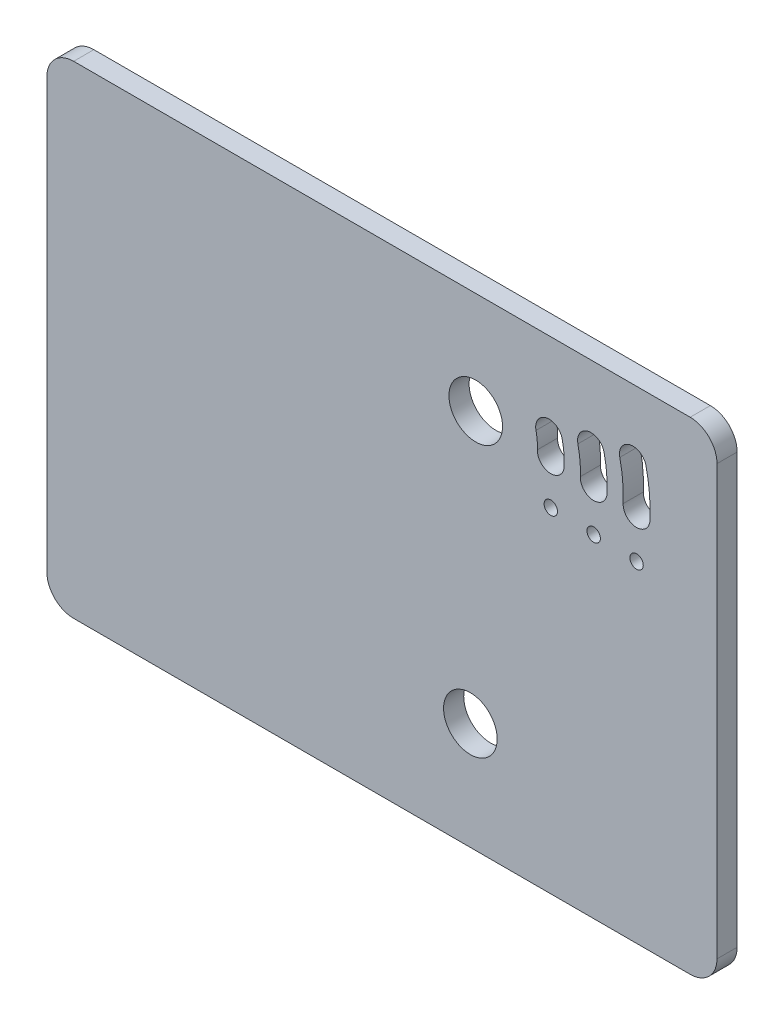
ISO-10303-21;
HEADER;
FILE_DESCRIPTION(('STEP AP214'),'2;1');
FILE_NAME('part.step','',(''),(''),'','','');
FILE_SCHEMA(('AUTOMOTIVE_DESIGN { 1 0 10303 214 1 1 1 1 }'));
ENDSEC;
DATA;
#1=APPLICATION_CONTEXT('core data for automotive mechanical design processes');
#2=APPLICATION_PROTOCOL_DEFINITION('international standard','automotive_design',2000,#1);
#3=PRODUCT_CONTEXT('',#1,'mechanical');
#4=PRODUCT('Part','Part','',(#3));
#5=PRODUCT_RELATED_PRODUCT_CATEGORY('part','',(#4));
#6=PRODUCT_DEFINITION_FORMATION('','',#4);
#7=PRODUCT_DEFINITION_CONTEXT('part definition',#1,'design');
#8=PRODUCT_DEFINITION('design','',#6,#7);
#9=PRODUCT_DEFINITION_SHAPE('','',#8);
#10=(LENGTH_UNIT() NAMED_UNIT(*) SI_UNIT(.MILLI.,.METRE.));
#11=(NAMED_UNIT(*) PLANE_ANGLE_UNIT() SI_UNIT($,.RADIAN.));
#12=(NAMED_UNIT(*) SI_UNIT($,.STERADIAN.) SOLID_ANGLE_UNIT());
#13=UNCERTAINTY_MEASURE_WITH_UNIT(LENGTH_MEASURE(1.E-05),#10,'distance_accuracy_value','');
#14=(GEOMETRIC_REPRESENTATION_CONTEXT(3) GLOBAL_UNCERTAINTY_ASSIGNED_CONTEXT((#13)) GLOBAL_UNIT_ASSIGNED_CONTEXT((#10,
#11,#12)) REPRESENTATION_CONTEXT('',''));
#15=CARTESIAN_POINT('',(0.,0.,0.));
#16=DIRECTION('',(0.,0.,1.));
#17=DIRECTION('',(1.,0.,0.));
#18=AXIS2_PLACEMENT_3D('',#15,#16,#17);
#19=CARTESIAN_POINT('',(0.,0.,4.7752));
#20=DIRECTION('',(0.,0.,-1.));
#21=DIRECTION('',(-1.,0.,0.));
#22=AXIS2_PLACEMENT_3D('',#19,#20,#21);
#23=PLANE('',#22);
#24=CARTESIAN_POINT('',(100.33,25.4,4.7752));
#25=DIRECTION('',(0.,0.,1.));
#26=DIRECTION('',(1.,0.,0.));
#27=AXIS2_PLACEMENT_3D('',#24,#25,#26);
#28=CIRCLE('',#27,6.35);
#29=CARTESIAN_POINT('',(106.68,25.4,4.7752));
#30=VERTEX_POINT('',#29);
#31=EDGE_CURVE('E679',#30,#30,#28,.T.);
#32=ORIENTED_EDGE('',*,*,#31,.F.);
#33=EDGE_LOOP('',(#32));
#34=FACE_BOUND('',#33,.T.);
#35=CARTESIAN_POINT('',(139.7,88.5065180751856,4.7752));
#36=DIRECTION('',(0.,0.,1.));
#37=DIRECTION('',(1.,0.,0.));
#38=AXIS2_PLACEMENT_3D('',#35,#36,#37);
#39=CIRCLE('',#38,3.17500000000001);
#40=CARTESIAN_POINT('',(136.528021896478,88.6450096300705,4.7752));
#41=VERTEX_POINT('',#40);
#42=CARTESIAN_POINT('',(142.871978103522,88.3680265203006,4.7752));
#43=VERTEX_POINT('',#42);
#44=EDGE_CURVE('E217',#41,#43,#39,.T.);
#45=ORIENTED_EDGE('',*,*,#44,.F.);
#46=CARTESIAN_POINT('',(101.6,90.17,4.7752));
#47=DIRECTION('',(0.,0.,-1.));
#48=DIRECTION('',(1.,0.,0.));
#49=AXIS2_PLACEMENT_3D('',#46,#47,#48);
#50=CIRCLE('',#49,34.9612973047225);
#51=CARTESIAN_POINT('',(135.732574962333,97.7370096914093,4.7752));
#52=VERTEX_POINT('',#51);
#53=EDGE_CURVE('E225',#52,#41,#50,.T.);
#54=ORIENTED_EDGE('',*,*,#53,.F.);
#55=CARTESIAN_POINT('',(138.832314784939,98.4242054656628,4.7752));
#56=DIRECTION('',(0.,0.,1.));
#57=DIRECTION('',(1.,0.,0.));
#58=AXIS2_PLACEMENT_3D('',#55,#56,#57);
#59=CIRCLE('',#58,3.17500000000001);
#60=CARTESIAN_POINT('',(141.932054607545,99.1114012399162,4.7752));
#61=VERTEX_POINT('',#60);
#62=EDGE_CURVE('E222',#61,#52,#59,.T.);
#63=ORIENTED_EDGE('',*,*,#62,.F.);
#64=CARTESIAN_POINT('',(101.6,90.17,4.7752));
#65=DIRECTION('',(0.,0.,1.));
#66=DIRECTION('',(1.,0.,0.));
#67=AXIS2_PLACEMENT_3D('',#64,#65,#66);
#68=CIRCLE('',#67,41.3112973047225);
#69=EDGE_CURVE('E219',#43,#61,#68,.T.);
#70=ORIENTED_EDGE('',*,*,#69,.F.);
#71=EDGE_LOOP('',(#45,#54,#63,#70));
#72=FACE_BOUND('',#71,.T.);
#73=CARTESIAN_POINT('',(139.7,78.3465180751856,4.7752));
#74=DIRECTION('',(0.,0.,1.));
#75=DIRECTION('',(1.,0.,0.));
#76=AXIS2_PLACEMENT_3D('',#73,#74,#75);
#77=CIRCLE('',#76,1.58749999999999);
#78=CARTESIAN_POINT('',(141.2875,78.3465180751856,4.7752));
#79=VERTEX_POINT('',#78);
#80=EDGE_CURVE('E279',#79,#79,#77,.T.);
#81=ORIENTED_EDGE('',*,*,#80,.F.);
#82=EDGE_LOOP('',(#81));
#83=FACE_BOUND('',#82,.T.);
#84=CARTESIAN_POINT('',(129.54,78.7901132551361,4.7752));
#85=DIRECTION('',(0.,0.,1.));
#86=DIRECTION('',(1.,0.,0.));
#87=AXIS2_PLACEMENT_3D('',#84,#85,#86);
#88=CIRCLE('',#87,1.58749999999999);
#89=CARTESIAN_POINT('',(131.1275,78.7901132551361,4.7752));
#90=VERTEX_POINT('',#89);
#91=EDGE_CURVE('E285',#90,#90,#88,.T.);
#92=ORIENTED_EDGE('',*,*,#91,.F.);
#93=EDGE_LOOP('',(#92));
#94=FACE_BOUND('',#93,.T.);
#95=CARTESIAN_POINT('',(119.38,79.2337084350866,4.7752));
#96=DIRECTION('',(0.,0.,1.));
#97=DIRECTION('',(1.,0.,0.));
#98=AXIS2_PLACEMENT_3D('',#95,#96,#97);
#99=CIRCLE('',#98,1.58749999999999);
#100=CARTESIAN_POINT('',(120.9675,79.2337084350866,4.7752));
#101=VERTEX_POINT('',#100);
#102=EDGE_CURVE('E291',#101,#101,#99,.T.);
#103=ORIENTED_EDGE('',*,*,#102,.F.);
#104=EDGE_LOOP('',(#103));
#105=FACE_BOUND('',#104,.T.);
#106=CARTESIAN_POINT('',(101.6,90.17,4.7752));
#107=DIRECTION('',(0.,0.,1.));
#108=DIRECTION('',(1.,0.,0.));
#109=AXIS2_PLACEMENT_3D('',#106,#107,#108);
#110=CIRCLE('',#109,6.34999999999999);
#111=CARTESIAN_POINT('',(107.95,90.17,4.7752));
#112=VERTEX_POINT('',#111);
#113=EDGE_CURVE('E297',#112,#112,#110,.T.);
#114=ORIENTED_EDGE('',*,*,#113,.F.);
#115=EDGE_LOOP('',(#114));
#116=FACE_BOUND('',#115,.T.);
#117=DIRECTION('',(1.,0.,0.));
#118=VECTOR('',#117,1.);
#119=CARTESIAN_POINT('',(0.,0.,4.7752));
#120=LINE('',#119,#118);
#121=CARTESIAN_POINT('',(6.35,0.,4.7752));
#122=VERTEX_POINT('',#121);
#123=CARTESIAN_POINT('',(152.4,0.,4.7752));
#124=VERTEX_POINT('',#123);
#125=EDGE_CURVE('E306',#122,#124,#120,.T.);
#126=ORIENTED_EDGE('',*,*,#125,.T.);
#127=CARTESIAN_POINT('',(152.4,6.35,4.7752));
#128=DIRECTION('',(0.,0.,-1.));
#129=DIRECTION('',(-1.,0.,0.));
#130=AXIS2_PLACEMENT_3D('',#127,#128,#129);
#131=CIRCLE('',#130,6.35);
#132=CARTESIAN_POINT('',(158.75,6.35,4.7752));
#133=VERTEX_POINT('',#132);
#134=EDGE_CURVE('E346',#124,#133,#131,.F.);
#135=ORIENTED_EDGE('',*,*,#134,.T.);
#136=DIRECTION('',(0.,1.,0.));
#137=VECTOR('',#136,1.);
#138=CARTESIAN_POINT('',(158.75,0.,4.7752));
#139=LINE('',#138,#137);
#140=CARTESIAN_POINT('',(158.75,107.95,4.7752));
#141=VERTEX_POINT('',#140);
#142=EDGE_CURVE('E310',#133,#141,#139,.T.);
#143=ORIENTED_EDGE('',*,*,#142,.T.);
#144=CARTESIAN_POINT('',(152.4,107.95,4.7752));
#145=DIRECTION('',(0.,0.,-1.));
#146=DIRECTION('',(-1.,0.,0.));
#147=AXIS2_PLACEMENT_3D('',#144,#145,#146);
#148=CIRCLE('',#147,6.35);
#149=CARTESIAN_POINT('',(152.4,114.3,4.7752));
#150=VERTEX_POINT('',#149);
#151=EDGE_CURVE('E57',#141,#150,#148,.F.);
#152=ORIENTED_EDGE('',*,*,#151,.T.);
#153=DIRECTION('',(-1.,0.,0.));
#154=VECTOR('',#153,1.);
#155=CARTESIAN_POINT('',(0.,114.3,4.7752));
#156=LINE('',#155,#154);
#157=CARTESIAN_POINT('',(6.35,114.3,4.7752));
#158=VERTEX_POINT('',#157);
#159=EDGE_CURVE('E312',#150,#158,#156,.T.);
#160=ORIENTED_EDGE('',*,*,#159,.T.);
#161=CARTESIAN_POINT('',(6.35,107.95,4.7752));
#162=DIRECTION('',(0.,0.,-1.));
#163=DIRECTION('',(-1.,0.,0.));
#164=AXIS2_PLACEMENT_3D('',#161,#162,#163);
#165=CIRCLE('',#164,6.35);
#166=CARTESIAN_POINT('',(0.,107.95,4.7752));
#167=VERTEX_POINT('',#166);
#168=EDGE_CURVE('E341',#158,#167,#165,.F.);
#169=ORIENTED_EDGE('',*,*,#168,.T.);
#170=DIRECTION('',(0.,-1.,0.));
#171=VECTOR('',#170,1.);
#172=CARTESIAN_POINT('',(0.,0.,4.7752));
#173=LINE('',#172,#171);
#174=CARTESIAN_POINT('',(0.,6.35,4.7752));
#175=VERTEX_POINT('',#174);
#176=EDGE_CURVE('E303',#167,#175,#173,.T.);
#177=ORIENTED_EDGE('',*,*,#176,.T.);
#178=CARTESIAN_POINT('',(6.35,6.35,4.7752));
#179=DIRECTION('',(0.,0.,-1.));
#180=DIRECTION('',(-1.,0.,0.));
#181=AXIS2_PLACEMENT_3D('',#178,#179,#180);
#182=CIRCLE('',#181,6.35);
#183=EDGE_CURVE('E344',#175,#122,#182,.F.);
#184=ORIENTED_EDGE('',*,*,#183,.T.);
#185=EDGE_LOOP('',(#126,#135,#143,#152,#160,#169,#177,#184));
#186=FACE_BOUND('',#185,.T.);
#187=CARTESIAN_POINT('',(119.38,89.3937084350866,4.7752));
#188=DIRECTION('',(0.,0.,1.));
#189=DIRECTION('',(1.,0.,0.));
#190=AXIS2_PLACEMENT_3D('',#187,#188,#189);
#191=CIRCLE('',#190,3.17499999999999);
#192=CARTESIAN_POINT('',(116.208021896478,89.5321999899716,4.7752));
#193=VERTEX_POINT('',#192);
#194=CARTESIAN_POINT('',(122.551978103522,89.2552168802016,4.7752));
#195=VERTEX_POINT('',#194);
#196=EDGE_CURVE('E248',#193,#195,#191,.T.);
#197=ORIENTED_EDGE('',*,*,#196,.F.);
#198=CARTESIAN_POINT('',(101.6,90.17,4.7752));
#199=DIRECTION('',(0.,0.,-1.));
#200=DIRECTION('',(1.,0.,0.));
#201=AXIS2_PLACEMENT_3D('',#198,#199,#200);
#202=CIRCLE('',#201,14.6219387422038);
#203=CARTESIAN_POINT('',(115.875340410366,93.3347667763892,4.7752));
#204=VERTEX_POINT('',#203);
#205=EDGE_CURVE('E256',#204,#193,#202,.T.);
#206=ORIENTED_EDGE('',*,*,#205,.F.);
#207=CARTESIAN_POINT('',(118.975080232972,94.0219625506426,4.7752));
#208=DIRECTION('',(0.,0.,1.));
#209=DIRECTION('',(1.,0.,0.));
#210=AXIS2_PLACEMENT_3D('',#207,#208,#209);
#211=CIRCLE('',#210,3.175);
#212=CARTESIAN_POINT('',(122.074820055577,94.7091583248961,4.7752));
#213=VERTEX_POINT('',#212);
#214=EDGE_CURVE('E253',#213,#204,#211,.T.);
#215=ORIENTED_EDGE('',*,*,#214,.F.);
#216=CARTESIAN_POINT('',(101.6,90.17,4.7752));
#217=DIRECTION('',(0.,0.,1.));
#218=DIRECTION('',(1.,0.,0.));
#219=AXIS2_PLACEMENT_3D('',#216,#217,#218);
#220=CIRCLE('',#219,20.9719387422038);
#221=EDGE_CURVE('E250',#195,#213,#220,.T.);
#222=ORIENTED_EDGE('',*,*,#221,.F.);
#223=EDGE_LOOP('',(#197,#206,#215,#222));
#224=FACE_BOUND('',#223,.T.);
#225=CARTESIAN_POINT('',(129.54,88.9501132551361,4.7752));
#226=DIRECTION('',(0.,0.,1.));
#227=DIRECTION('',(1.,0.,0.));
#228=AXIS2_PLACEMENT_3D('',#225,#226,#227);
#229=CIRCLE('',#228,3.17500000000001);
#230=CARTESIAN_POINT('',(126.368021896478,89.088604810021,4.7752));
#231=VERTEX_POINT('',#230);
#232=CARTESIAN_POINT('',(132.711978103522,88.8116217002512,4.7752));
#233=VERTEX_POINT('',#232);
#234=EDGE_CURVE('E175',#231,#233,#229,.T.);
#235=ORIENTED_EDGE('',*,*,#234,.F.);
#236=CARTESIAN_POINT('',(101.6,90.17,4.7752));
#237=DIRECTION('',(0.,0.,-1.));
#238=DIRECTION('',(1.,0.,0.));
#239=AXIS2_PLACEMENT_3D('',#236,#237,#238);
#240=CIRCLE('',#239,24.7916180234632);
#241=CARTESIAN_POINT('',(125.80395768635,95.5358882338992,4.7752));
#242=VERTEX_POINT('',#241);
#243=EDGE_CURVE('E200',#242,#231,#240,.T.);
#244=ORIENTED_EDGE('',*,*,#243,.F.);
#245=CARTESIAN_POINT('',(128.903697508955,96.2230840081527,4.7752));
#246=DIRECTION('',(0.,0.,1.));
#247=DIRECTION('',(1.,0.,0.));
#248=AXIS2_PLACEMENT_3D('',#245,#246,#247);
#249=CIRCLE('',#248,3.17499999999999);
#250=CARTESIAN_POINT('',(132.003437331561,96.9102797824061,4.7752));
#251=VERTEX_POINT('',#250);
#252=EDGE_CURVE('E198',#251,#242,#249,.T.);
#253=ORIENTED_EDGE('',*,*,#252,.F.);
#254=CARTESIAN_POINT('',(101.6,90.17,4.7752));
#255=DIRECTION('',(0.,0.,1.));
#256=DIRECTION('',(1.,0.,0.));
#257=AXIS2_PLACEMENT_3D('',#254,#255,#256);
#258=CIRCLE('',#257,31.1416180234632);
#259=EDGE_CURVE('E185',#233,#251,#258,.T.);
#260=ORIENTED_EDGE('',*,*,#259,.F.);
#261=EDGE_LOOP('',(#235,#244,#253,#260));
#262=FACE_BOUND('',#261,.T.);
#263=ADVANCED_FACE('F35',(#34,#72,#83,#94,#105,#116,#186,#224,#262),#23,.F.);
#264=CARTESIAN_POINT('',(0.,0.,0.));
#265=DIRECTION('',(0.,0.,-1.));
#266=DIRECTION('',(-1.,0.,0.));
#267=AXIS2_PLACEMENT_3D('',#264,#265,#266);
#268=PLANE('',#267);
#269=CARTESIAN_POINT('',(100.33,25.4,0.));
#270=DIRECTION('',(0.,0.,-1.));
#271=DIRECTION('',(-1.,0.,0.));
#272=AXIS2_PLACEMENT_3D('',#269,#270,#271);
#273=CIRCLE('',#272,6.35);
#274=CARTESIAN_POINT('',(93.98,25.4,0.));
#275=VERTEX_POINT('',#274);
#276=EDGE_CURVE('E39',#275,#275,#273,.T.);
#277=ORIENTED_EDGE('',*,*,#276,.F.);
#278=EDGE_LOOP('',(#277));
#279=FACE_BOUND('',#278,.T.);
#280=CARTESIAN_POINT('',(129.54,78.7901132551361,0.));
#281=DIRECTION('',(0.,0.,1.));
#282=DIRECTION('',(1.,0.,0.));
#283=AXIS2_PLACEMENT_3D('',#280,#281,#282);
#284=CIRCLE('',#283,1.58749999999999);
#285=CARTESIAN_POINT('',(131.1275,78.7901132551361,0.));
#286=VERTEX_POINT('',#285);
#287=EDGE_CURVE('E282',#286,#286,#284,.T.);
#288=ORIENTED_EDGE('',*,*,#287,.T.);
#289=EDGE_LOOP('',(#288));
#290=FACE_BOUND('',#289,.T.);
#291=CARTESIAN_POINT('',(101.6,90.17,0.));
#292=DIRECTION('',(0.,0.,1.));
#293=DIRECTION('',(1.,0.,0.));
#294=AXIS2_PLACEMENT_3D('',#291,#292,#293);
#295=CIRCLE('',#294,6.34999999999999);
#296=CARTESIAN_POINT('',(107.95,90.17,0.));
#297=VERTEX_POINT('',#296);
#298=EDGE_CURVE('E294',#297,#297,#295,.T.);
#299=ORIENTED_EDGE('',*,*,#298,.T.);
#300=EDGE_LOOP('',(#299));
#301=FACE_BOUND('',#300,.T.);
#302=DIRECTION('',(0.,1.,0.));
#303=VECTOR('',#302,1.);
#304=CARTESIAN_POINT('',(158.75,0.,0.));
#305=LINE('',#304,#303);
#306=CARTESIAN_POINT('',(158.75,6.35,0.));
#307=VERTEX_POINT('',#306);
#308=CARTESIAN_POINT('',(158.75,107.95,0.));
#309=VERTEX_POINT('',#308);
#310=EDGE_CURVE('E320',#307,#309,#305,.T.);
#311=ORIENTED_EDGE('',*,*,#310,.F.);
#312=CARTESIAN_POINT('',(152.4,6.35,0.));
#313=DIRECTION('',(0.,0.,-1.));
#314=DIRECTION('',(-1.,0.,0.));
#315=AXIS2_PLACEMENT_3D('',#312,#313,#314);
#316=CIRCLE('',#315,6.35);
#317=CARTESIAN_POINT('',(152.4,0.,0.));
#318=VERTEX_POINT('',#317);
#319=EDGE_CURVE('E334',#307,#318,#316,.T.);
#320=ORIENTED_EDGE('',*,*,#319,.T.);
#321=DIRECTION('',(1.,0.,0.));
#322=VECTOR('',#321,1.);
#323=CARTESIAN_POINT('',(0.,0.,0.));
#324=LINE('',#323,#322);
#325=CARTESIAN_POINT('',(6.35,0.,0.));
#326=VERTEX_POINT('',#325);
#327=EDGE_CURVE('E317',#326,#318,#324,.T.);
#328=ORIENTED_EDGE('',*,*,#327,.F.);
#329=CARTESIAN_POINT('',(6.35,6.35,0.));
#330=DIRECTION('',(0.,0.,-1.));
#331=DIRECTION('',(-1.,0.,0.));
#332=AXIS2_PLACEMENT_3D('',#329,#330,#331);
#333=CIRCLE('',#332,6.35);
#334=CARTESIAN_POINT('',(0.,6.35,0.));
#335=VERTEX_POINT('',#334);
#336=EDGE_CURVE('E332',#326,#335,#333,.T.);
#337=ORIENTED_EDGE('',*,*,#336,.T.);
#338=DIRECTION('',(0.,-1.,0.));
#339=VECTOR('',#338,1.);
#340=CARTESIAN_POINT('',(0.,0.,0.));
#341=LINE('',#340,#339);
#342=CARTESIAN_POINT('',(0.,107.95,0.));
#343=VERTEX_POINT('',#342);
#344=EDGE_CURVE('E300',#343,#335,#341,.T.);
#345=ORIENTED_EDGE('',*,*,#344,.F.);
#346=CARTESIAN_POINT('',(6.35,107.95,0.));
#347=DIRECTION('',(0.,0.,-1.));
#348=DIRECTION('',(-1.,0.,0.));
#349=AXIS2_PLACEMENT_3D('',#346,#347,#348);
#350=CIRCLE('',#349,6.35);
#351=CARTESIAN_POINT('',(6.35,114.3,0.));
#352=VERTEX_POINT('',#351);
#353=EDGE_CURVE('E328',#343,#352,#350,.T.);
#354=ORIENTED_EDGE('',*,*,#353,.T.);
#355=DIRECTION('',(-1.,0.,0.));
#356=VECTOR('',#355,1.);
#357=CARTESIAN_POINT('',(0.,114.3,0.));
#358=LINE('',#357,#356);
#359=CARTESIAN_POINT('',(152.4,114.3,0.));
#360=VERTEX_POINT('',#359);
#361=EDGE_CURVE('E307',#360,#352,#358,.T.);
#362=ORIENTED_EDGE('',*,*,#361,.F.);
#363=CARTESIAN_POINT('',(152.4,107.95,0.));
#364=DIRECTION('',(0.,0.,-1.));
#365=DIRECTION('',(-1.,0.,0.));
#366=AXIS2_PLACEMENT_3D('',#363,#364,#365);
#367=CIRCLE('',#366,6.35);
#368=EDGE_CURVE('E330',#360,#309,#367,.T.);
#369=ORIENTED_EDGE('',*,*,#368,.T.);
#370=EDGE_LOOP('',(#311,#320,#328,#337,#345,#354,#362,#369));
#371=FACE_BOUND('',#370,.T.);
#372=CARTESIAN_POINT('',(119.38,79.2337084350866,0.));
#373=DIRECTION('',(0.,0.,1.));
#374=DIRECTION('',(1.,0.,0.));
#375=AXIS2_PLACEMENT_3D('',#372,#373,#374);
#376=CIRCLE('',#375,1.58749999999999);
#377=CARTESIAN_POINT('',(120.9675,79.2337084350866,0.));
#378=VERTEX_POINT('',#377);
#379=EDGE_CURVE('E288',#378,#378,#376,.T.);
#380=ORIENTED_EDGE('',*,*,#379,.T.);
#381=EDGE_LOOP('',(#380));
#382=FACE_BOUND('',#381,.T.);
#383=CARTESIAN_POINT('',(139.7,78.3465180751856,0.));
#384=DIRECTION('',(0.,0.,1.));
#385=DIRECTION('',(1.,0.,0.));
#386=AXIS2_PLACEMENT_3D('',#383,#384,#385);
#387=CIRCLE('',#386,1.58749999999999);
#388=CARTESIAN_POINT('',(141.2875,78.3465180751856,0.));
#389=VERTEX_POINT('',#388);
#390=EDGE_CURVE('E278',#389,#389,#387,.T.);
#391=ORIENTED_EDGE('',*,*,#390,.T.);
#392=EDGE_LOOP('',(#391));
#393=FACE_BOUND('',#392,.T.);
#394=CARTESIAN_POINT('',(101.6,90.17,0.));
#395=DIRECTION('',(0.,0.,-1.));
#396=DIRECTION('',(1.,0.,0.));
#397=AXIS2_PLACEMENT_3D('',#394,#395,#396);
#398=CIRCLE('',#397,14.6219387422038);
#399=CARTESIAN_POINT('',(115.875340410366,93.3347667763892,0.));
#400=VERTEX_POINT('',#399);
#401=CARTESIAN_POINT('',(116.208021896478,89.5321999899716,0.));
#402=VERTEX_POINT('',#401);
#403=EDGE_CURVE('E251',#400,#402,#398,.T.);
#404=ORIENTED_EDGE('',*,*,#403,.T.);
#405=CARTESIAN_POINT('',(119.38,89.3937084350866,0.));
#406=DIRECTION('',(0.,0.,1.));
#407=DIRECTION('',(1.,0.,0.));
#408=AXIS2_PLACEMENT_3D('',#405,#406,#407);
#409=CIRCLE('',#408,3.17499999999999);
#410=CARTESIAN_POINT('',(122.551978103522,89.2552168802016,0.));
#411=VERTEX_POINT('',#410);
#412=EDGE_CURVE('E247',#402,#411,#409,.T.);
#413=ORIENTED_EDGE('',*,*,#412,.T.);
#414=CARTESIAN_POINT('',(101.6,90.17,0.));
#415=DIRECTION('',(0.,0.,1.));
#416=DIRECTION('',(1.,0.,0.));
#417=AXIS2_PLACEMENT_3D('',#414,#415,#416);
#418=CIRCLE('',#417,20.9719387422038);
#419=CARTESIAN_POINT('',(122.074820055577,94.7091583248961,0.));
#420=VERTEX_POINT('',#419);
#421=EDGE_CURVE('E261',#411,#420,#418,.T.);
#422=ORIENTED_EDGE('',*,*,#421,.T.);
#423=CARTESIAN_POINT('',(118.975080232972,94.0219625506426,0.));
#424=DIRECTION('',(0.,0.,1.));
#425=DIRECTION('',(1.,0.,0.));
#426=AXIS2_PLACEMENT_3D('',#423,#424,#425);
#427=CIRCLE('',#426,3.175);
#428=EDGE_CURVE('E264',#420,#400,#427,.T.);
#429=ORIENTED_EDGE('',*,*,#428,.T.);
#430=EDGE_LOOP('',(#404,#413,#422,#429));
#431=FACE_BOUND('',#430,.T.);
#432=CARTESIAN_POINT('',(101.6,90.17,0.));
#433=DIRECTION('',(0.,0.,-1.));
#434=DIRECTION('',(1.,0.,0.));
#435=AXIS2_PLACEMENT_3D('',#432,#433,#434);
#436=CIRCLE('',#435,34.9612973047225);
#437=CARTESIAN_POINT('',(135.732574962333,97.7370096914093,0.));
#438=VERTEX_POINT('',#437);
#439=CARTESIAN_POINT('',(136.528021896478,88.6450096300705,0.));
#440=VERTEX_POINT('',#439);
#441=EDGE_CURVE('E220',#438,#440,#436,.T.);
#442=ORIENTED_EDGE('',*,*,#441,.T.);
#443=CARTESIAN_POINT('',(139.7,88.5065180751856,0.));
#444=DIRECTION('',(0.,0.,1.));
#445=DIRECTION('',(1.,0.,0.));
#446=AXIS2_PLACEMENT_3D('',#443,#444,#445);
#447=CIRCLE('',#446,3.17500000000001);
#448=CARTESIAN_POINT('',(142.871978103522,88.3680265203006,0.));
#449=VERTEX_POINT('',#448);
#450=EDGE_CURVE('E193',#440,#449,#447,.T.);
#451=ORIENTED_EDGE('',*,*,#450,.T.);
#452=CARTESIAN_POINT('',(101.6,90.17,0.));
#453=DIRECTION('',(0.,0.,1.));
#454=DIRECTION('',(1.,0.,0.));
#455=AXIS2_PLACEMENT_3D('',#452,#453,#454);
#456=CIRCLE('',#455,41.3112973047225);
#457=CARTESIAN_POINT('',(141.932054607545,99.1114012399162,0.));
#458=VERTEX_POINT('',#457);
#459=EDGE_CURVE('E230',#449,#458,#456,.T.);
#460=ORIENTED_EDGE('',*,*,#459,.T.);
#461=CARTESIAN_POINT('',(138.832314784939,98.4242054656628,0.));
#462=DIRECTION('',(0.,0.,1.));
#463=DIRECTION('',(1.,0.,0.));
#464=AXIS2_PLACEMENT_3D('',#461,#462,#463);
#465=CIRCLE('',#464,3.17500000000001);
#466=EDGE_CURVE('E233',#458,#438,#465,.T.);
#467=ORIENTED_EDGE('',*,*,#466,.T.);
#468=EDGE_LOOP('',(#442,#451,#460,#467));
#469=FACE_BOUND('',#468,.T.);
#470=CARTESIAN_POINT('',(101.6,90.17,0.));
#471=DIRECTION('',(0.,0.,-1.));
#472=DIRECTION('',(1.,0.,0.));
#473=AXIS2_PLACEMENT_3D('',#470,#471,#472);
#474=CIRCLE('',#473,24.7916180234632);
#475=CARTESIAN_POINT('',(125.80395768635,95.5358882338992,0.));
#476=VERTEX_POINT('',#475);
#477=CARTESIAN_POINT('',(126.368021896478,89.088604810021,0.));
#478=VERTEX_POINT('',#477);
#479=EDGE_CURVE('E186',#476,#478,#474,.T.);
#480=ORIENTED_EDGE('',*,*,#479,.T.);
#481=CARTESIAN_POINT('',(129.54,88.9501132551361,0.));
#482=DIRECTION('',(0.,0.,1.));
#483=DIRECTION('',(1.,0.,0.));
#484=AXIS2_PLACEMENT_3D('',#481,#482,#483);
#485=CIRCLE('',#484,3.17500000000001);
#486=CARTESIAN_POINT('',(132.711978103522,88.8116217002512,0.));
#487=VERTEX_POINT('',#486);
#488=EDGE_CURVE('E205',#478,#487,#485,.T.);
#489=ORIENTED_EDGE('',*,*,#488,.T.);
#490=CARTESIAN_POINT('',(101.6,90.17,0.));
#491=DIRECTION('',(0.,0.,1.));
#492=DIRECTION('',(1.,0.,0.));
#493=AXIS2_PLACEMENT_3D('',#490,#491,#492);
#494=CIRCLE('',#493,31.1416180234632);
#495=CARTESIAN_POINT('',(132.003437331561,96.9102797824061,0.));
#496=VERTEX_POINT('',#495);
#497=EDGE_CURVE('E192',#487,#496,#494,.T.);
#498=ORIENTED_EDGE('',*,*,#497,.T.);
#499=CARTESIAN_POINT('',(128.903697508955,96.2230840081527,0.));
#500=DIRECTION('',(0.,0.,1.));
#501=DIRECTION('',(1.,0.,0.));
#502=AXIS2_PLACEMENT_3D('',#499,#500,#501);
#503=CIRCLE('',#502,3.17499999999999);
#504=EDGE_CURVE('E208',#496,#476,#503,.T.);
#505=ORIENTED_EDGE('',*,*,#504,.T.);
#506=EDGE_LOOP('',(#480,#489,#498,#505));
#507=FACE_BOUND('',#506,.T.);
#508=ADVANCED_FACE('F372',(#279,#290,#301,#371,#382,#393,#431,#469,#507),#268,.T.);
#509=CARTESIAN_POINT('',(0.,0.,4.7752));
#510=DIRECTION('',(1.,0.,0.));
#511=DIRECTION('',(0.,0.,-1.));
#512=AXIS2_PLACEMENT_3D('',#509,#510,#511);
#513=PLANE('',#512);
#514=ORIENTED_EDGE('',*,*,#344,.T.);
#515=DIRECTION('',(0.,0.,-1.));
#516=VECTOR('',#515,1.);
#517=CARTESIAN_POINT('',(0.,6.35,4.7752));
#518=LINE('',#517,#516);
#519=EDGE_CURVE('E351',#335,#175,#518,.F.);
#520=ORIENTED_EDGE('',*,*,#519,.T.);
#521=ORIENTED_EDGE('',*,*,#176,.F.);
#522=DIRECTION('',(0.,0.,-1.));
#523=VECTOR('',#522,1.);
#524=CARTESIAN_POINT('',(0.,107.95,4.7752));
#525=LINE('',#524,#523);
#526=EDGE_CURVE('E348',#167,#343,#525,.T.);
#527=ORIENTED_EDGE('',*,*,#526,.T.);
#528=EDGE_LOOP('',(#514,#520,#521,#527));
#529=FACE_BOUND('',#528,.T.);
#530=ADVANCED_FACE('F356',(#529),#513,.F.);
#531=CARTESIAN_POINT('',(0.,0.,4.7752));
#532=DIRECTION('',(0.,1.,0.));
#533=DIRECTION('',(0.,0.,1.));
#534=AXIS2_PLACEMENT_3D('',#531,#532,#533);
#535=PLANE('',#534);
#536=ORIENTED_EDGE('',*,*,#327,.T.);
#537=DIRECTION('',(0.,0.,-1.));
#538=VECTOR('',#537,1.);
#539=CARTESIAN_POINT('',(152.4,0.,4.7752));
#540=LINE('',#539,#538);
#541=EDGE_CURVE('E339',#318,#124,#540,.F.);
#542=ORIENTED_EDGE('',*,*,#541,.T.);
#543=ORIENTED_EDGE('',*,*,#125,.F.);
#544=DIRECTION('',(0.,0.,-1.));
#545=VECTOR('',#544,1.);
#546=CARTESIAN_POINT('',(6.35,0.,4.7752));
#547=LINE('',#546,#545);
#548=EDGE_CURVE('E336',#122,#326,#547,.T.);
#549=ORIENTED_EDGE('',*,*,#548,.T.);
#550=EDGE_LOOP('',(#536,#542,#543,#549));
#551=FACE_BOUND('',#550,.T.);
#552=ADVANCED_FACE('F368',(#551),#535,.F.);
#553=CARTESIAN_POINT('',(158.75,0.,4.7752));
#554=DIRECTION('',(-1.,0.,0.));
#555=DIRECTION('',(0.,0.,1.));
#556=AXIS2_PLACEMENT_3D('',#553,#554,#555);
#557=PLANE('',#556);
#558=ORIENTED_EDGE('',*,*,#142,.F.);
#559=DIRECTION('',(0.,0.,-1.));
#560=VECTOR('',#559,1.);
#561=CARTESIAN_POINT('',(158.75,6.35,4.7752));
#562=LINE('',#561,#560);
#563=EDGE_CURVE('E325',#133,#307,#562,.T.);
#564=ORIENTED_EDGE('',*,*,#563,.T.);
#565=ORIENTED_EDGE('',*,*,#310,.T.);
#566=DIRECTION('',(0.,0.,-1.));
#567=VECTOR('',#566,1.);
#568=CARTESIAN_POINT('',(158.75,107.95,4.7752));
#569=LINE('',#568,#567);
#570=EDGE_CURVE('E314',#309,#141,#569,.F.);
#571=ORIENTED_EDGE('',*,*,#570,.T.);
#572=EDGE_LOOP('',(#558,#564,#565,#571));
#573=FACE_BOUND('',#572,.T.);
#574=ADVANCED_FACE('F380',(#573),#557,.F.);
#575=CARTESIAN_POINT('',(0.,114.3,4.7752));
#576=DIRECTION('',(0.,-1.,0.));
#577=DIRECTION('',(0.,0.,-1.));
#578=AXIS2_PLACEMENT_3D('',#575,#576,#577);
#579=PLANE('',#578);
#580=ORIENTED_EDGE('',*,*,#159,.F.);
#581=DIRECTION('',(0.,0.,-1.));
#582=VECTOR('',#581,1.);
#583=CARTESIAN_POINT('',(152.4,114.3,4.7752));
#584=LINE('',#583,#582);
#585=EDGE_CURVE('E11',#150,#360,#584,.T.);
#586=ORIENTED_EDGE('',*,*,#585,.T.);
#587=ORIENTED_EDGE('',*,*,#361,.T.);
#588=DIRECTION('',(0.,0.,-1.));
#589=VECTOR('',#588,1.);
#590=CARTESIAN_POINT('',(6.35,114.3,4.7752));
#591=LINE('',#590,#589);
#592=EDGE_CURVE('E44',#352,#158,#591,.F.);
#593=ORIENTED_EDGE('',*,*,#592,.T.);
#594=EDGE_LOOP('',(#580,#586,#587,#593));
#595=FACE_BOUND('',#594,.T.);
#596=ADVANCED_FACE('F386',(#595),#579,.F.);
#597=CARTESIAN_POINT('',(101.6,90.17,4.7752));
#598=DIRECTION('',(0.,0.,-1.));
#599=DIRECTION('',(-1.,0.,0.));
#600=AXIS2_PLACEMENT_3D('',#597,#598,#599);
#601=CYLINDRICAL_SURFACE('',#600,6.34999999999999);
#602=ORIENTED_EDGE('',*,*,#113,.T.);
#603=EDGE_LOOP('',(#602));
#604=FACE_BOUND('',#603,.T.);
#605=ORIENTED_EDGE('',*,*,#298,.F.);
#606=EDGE_LOOP('',(#605));
#607=FACE_BOUND('',#606,.T.);
#608=ADVANCED_FACE('F407',(#604,#607),#601,.F.);
#609=CARTESIAN_POINT('',(119.38,79.2337084350866,4.7752));
#610=DIRECTION('',(0.,0.,-1.));
#611=DIRECTION('',(-1.,0.,0.));
#612=AXIS2_PLACEMENT_3D('',#609,#610,#611);
#613=CYLINDRICAL_SURFACE('',#612,1.58749999999999);
#614=ORIENTED_EDGE('',*,*,#102,.T.);
#615=EDGE_LOOP('',(#614));
#616=FACE_BOUND('',#615,.T.);
#617=ORIENTED_EDGE('',*,*,#379,.F.);
#618=EDGE_LOOP('',(#617));
#619=FACE_BOUND('',#618,.T.);
#620=ADVANCED_FACE('F476',(#616,#619),#613,.F.);
#621=CARTESIAN_POINT('',(129.54,78.7901132551361,4.7752));
#622=DIRECTION('',(0.,0.,-1.));
#623=DIRECTION('',(-1.,0.,0.));
#624=AXIS2_PLACEMENT_3D('',#621,#622,#623);
#625=CYLINDRICAL_SURFACE('',#624,1.58749999999999);
#626=ORIENTED_EDGE('',*,*,#91,.T.);
#627=EDGE_LOOP('',(#626));
#628=FACE_BOUND('',#627,.T.);
#629=ORIENTED_EDGE('',*,*,#287,.F.);
#630=EDGE_LOOP('',(#629));
#631=FACE_BOUND('',#630,.T.);
#632=ADVANCED_FACE('F483',(#628,#631),#625,.F.);
#633=CARTESIAN_POINT('',(139.7,78.3465180751856,4.7752));
#634=DIRECTION('',(0.,0.,-1.));
#635=DIRECTION('',(-1.,0.,0.));
#636=AXIS2_PLACEMENT_3D('',#633,#634,#635);
#637=CYLINDRICAL_SURFACE('',#636,1.58749999999999);
#638=ORIENTED_EDGE('',*,*,#80,.T.);
#639=EDGE_LOOP('',(#638));
#640=FACE_BOUND('',#639,.T.);
#641=ORIENTED_EDGE('',*,*,#390,.F.);
#642=EDGE_LOOP('',(#641));
#643=FACE_BOUND('',#642,.T.);
#644=ADVANCED_FACE('F490',(#640,#643),#637,.F.);
#645=CARTESIAN_POINT('',(119.38,89.3937084350866,4.7752));
#646=DIRECTION('',(0.,0.,-1.));
#647=DIRECTION('',(-1.,0.,0.));
#648=AXIS2_PLACEMENT_3D('',#645,#646,#647);
#649=CYLINDRICAL_SURFACE('',#648,3.17499999999999);
#650=ORIENTED_EDGE('',*,*,#412,.F.);
#651=DIRECTION('',(0.,0.,-1.));
#652=VECTOR('',#651,1.);
#653=CARTESIAN_POINT('',(116.208021896478,89.5321999899716,4.7752));
#654=LINE('',#653,#652);
#655=EDGE_CURVE('E258',#193,#402,#654,.T.);
#656=ORIENTED_EDGE('',*,*,#655,.F.);
#657=ORIENTED_EDGE('',*,*,#196,.T.);
#658=DIRECTION('',(0.,0.,-1.));
#659=VECTOR('',#658,1.);
#660=CARTESIAN_POINT('',(122.551978103522,89.2552168802016,4.7752));
#661=LINE('',#660,#659);
#662=EDGE_CURVE('E275',#195,#411,#661,.T.);
#663=ORIENTED_EDGE('',*,*,#662,.T.);
#664=EDGE_LOOP('',(#650,#656,#657,#663));
#665=FACE_BOUND('',#664,.T.);
#666=ADVANCED_FACE('F498',(#665),#649,.F.);
#667=CARTESIAN_POINT('',(101.6,90.17,4.7752));
#668=DIRECTION('',(0.,0.,-1.));
#669=DIRECTION('',(-1.,0.,0.));
#670=AXIS2_PLACEMENT_3D('',#667,#668,#669);
#671=CYLINDRICAL_SURFACE('',#670,20.9719387422038);
#672=ORIENTED_EDGE('',*,*,#421,.F.);
#673=ORIENTED_EDGE('',*,*,#662,.F.);
#674=ORIENTED_EDGE('',*,*,#221,.T.);
#675=DIRECTION('',(0.,0.,-1.));
#676=VECTOR('',#675,1.);
#677=CARTESIAN_POINT('',(122.074820055577,94.7091583248961,4.7752));
#678=LINE('',#677,#676);
#679=EDGE_CURVE('E273',#213,#420,#678,.T.);
#680=ORIENTED_EDGE('',*,*,#679,.T.);
#681=EDGE_LOOP('',(#672,#673,#674,#680));
#682=FACE_BOUND('',#681,.T.);
#683=ADVANCED_FACE('F506',(#682),#671,.F.);
#684=CARTESIAN_POINT('',(118.975080232972,94.0219625506426,4.7752));
#685=DIRECTION('',(0.,0.,-1.));
#686=DIRECTION('',(-1.,0.,0.));
#687=AXIS2_PLACEMENT_3D('',#684,#685,#686);
#688=CYLINDRICAL_SURFACE('',#687,3.175);
#689=ORIENTED_EDGE('',*,*,#428,.F.);
#690=ORIENTED_EDGE('',*,*,#679,.F.);
#691=ORIENTED_EDGE('',*,*,#214,.T.);
#692=DIRECTION('',(0.,0.,-1.));
#693=VECTOR('',#692,1.);
#694=CARTESIAN_POINT('',(115.875340410366,93.3347667763892,4.7752));
#695=LINE('',#694,#693);
#696=EDGE_CURVE('E271',#204,#400,#695,.T.);
#697=ORIENTED_EDGE('',*,*,#696,.T.);
#698=EDGE_LOOP('',(#689,#690,#691,#697));
#699=FACE_BOUND('',#698,.T.);
#700=ADVANCED_FACE('F514',(#699),#688,.F.);
#701=CARTESIAN_POINT('',(101.6,90.17,4.7752));
#702=DIRECTION('',(0.,0.,-1.));
#703=DIRECTION('',(-1.,0.,0.));
#704=AXIS2_PLACEMENT_3D('',#701,#702,#703);
#705=CYLINDRICAL_SURFACE('',#704,14.6219387422038);
#706=ORIENTED_EDGE('',*,*,#403,.F.);
#707=ORIENTED_EDGE('',*,*,#696,.F.);
#708=ORIENTED_EDGE('',*,*,#205,.T.);
#709=ORIENTED_EDGE('',*,*,#655,.T.);
#710=EDGE_LOOP('',(#706,#707,#708,#709));
#711=FACE_BOUND('',#710,.T.);
#712=ADVANCED_FACE('F522',(#711),#705,.T.);
#713=CARTESIAN_POINT('',(139.7,88.5065180751856,4.7752));
#714=DIRECTION('',(0.,0.,-1.));
#715=DIRECTION('',(-1.,0.,0.));
#716=AXIS2_PLACEMENT_3D('',#713,#714,#715);
#717=CYLINDRICAL_SURFACE('',#716,3.17500000000001);
#718=ORIENTED_EDGE('',*,*,#450,.F.);
#719=DIRECTION('',(0.,0.,-1.));
#720=VECTOR('',#719,1.);
#721=CARTESIAN_POINT('',(136.528021896478,88.6450096300705,4.7752));
#722=LINE('',#721,#720);
#723=EDGE_CURVE('E227',#41,#440,#722,.T.);
#724=ORIENTED_EDGE('',*,*,#723,.F.);
#725=ORIENTED_EDGE('',*,*,#44,.T.);
#726=DIRECTION('',(0.,0.,-1.));
#727=VECTOR('',#726,1.);
#728=CARTESIAN_POINT('',(142.871978103522,88.3680265203006,4.7752));
#729=LINE('',#728,#727);
#730=EDGE_CURVE('E244',#43,#449,#729,.T.);
#731=ORIENTED_EDGE('',*,*,#730,.T.);
#732=EDGE_LOOP('',(#718,#724,#725,#731));
#733=FACE_BOUND('',#732,.T.);
#734=ADVANCED_FACE('F530',(#733),#717,.F.);
#735=CARTESIAN_POINT('',(101.6,90.17,4.7752));
#736=DIRECTION('',(0.,0.,-1.));
#737=DIRECTION('',(-1.,0.,0.));
#738=AXIS2_PLACEMENT_3D('',#735,#736,#737);
#739=CYLINDRICAL_SURFACE('',#738,41.3112973047225);
#740=ORIENTED_EDGE('',*,*,#459,.F.);
#741=ORIENTED_EDGE('',*,*,#730,.F.);
#742=ORIENTED_EDGE('',*,*,#69,.T.);
#743=DIRECTION('',(0.,0.,-1.));
#744=VECTOR('',#743,1.);
#745=CARTESIAN_POINT('',(141.932054607545,99.1114012399162,4.7752));
#746=LINE('',#745,#744);
#747=EDGE_CURVE('E242',#61,#458,#746,.T.);
#748=ORIENTED_EDGE('',*,*,#747,.T.);
#749=EDGE_LOOP('',(#740,#741,#742,#748));
#750=FACE_BOUND('',#749,.T.);
#751=ADVANCED_FACE('F538',(#750),#739,.F.);
#752=CARTESIAN_POINT('',(138.832314784939,98.4242054656628,4.7752));
#753=DIRECTION('',(0.,0.,-1.));
#754=DIRECTION('',(-1.,0.,0.));
#755=AXIS2_PLACEMENT_3D('',#752,#753,#754);
#756=CYLINDRICAL_SURFACE('',#755,3.17500000000001);
#757=ORIENTED_EDGE('',*,*,#466,.F.);
#758=ORIENTED_EDGE('',*,*,#747,.F.);
#759=ORIENTED_EDGE('',*,*,#62,.T.);
#760=DIRECTION('',(0.,0.,-1.));
#761=VECTOR('',#760,1.);
#762=CARTESIAN_POINT('',(135.732574962333,97.7370096914093,4.7752));
#763=LINE('',#762,#761);
#764=EDGE_CURVE('E240',#52,#438,#763,.T.);
#765=ORIENTED_EDGE('',*,*,#764,.T.);
#766=EDGE_LOOP('',(#757,#758,#759,#765));
#767=FACE_BOUND('',#766,.T.);
#768=ADVANCED_FACE('F546',(#767),#756,.F.);
#769=CARTESIAN_POINT('',(101.6,90.17,4.7752));
#770=DIRECTION('',(0.,0.,-1.));
#771=DIRECTION('',(-1.,0.,0.));
#772=AXIS2_PLACEMENT_3D('',#769,#770,#771);
#773=CYLINDRICAL_SURFACE('',#772,34.9612973047225);
#774=ORIENTED_EDGE('',*,*,#441,.F.);
#775=ORIENTED_EDGE('',*,*,#764,.F.);
#776=ORIENTED_EDGE('',*,*,#53,.T.);
#777=ORIENTED_EDGE('',*,*,#723,.T.);
#778=EDGE_LOOP('',(#774,#775,#776,#777));
#779=FACE_BOUND('',#778,.T.);
#780=ADVANCED_FACE('F554',(#779),#773,.T.);
#781=CARTESIAN_POINT('',(129.54,88.9501132551361,4.7752));
#782=DIRECTION('',(0.,0.,-1.));
#783=DIRECTION('',(-1.,0.,0.));
#784=AXIS2_PLACEMENT_3D('',#781,#782,#783);
#785=CYLINDRICAL_SURFACE('',#784,3.17500000000001);
#786=ORIENTED_EDGE('',*,*,#488,.F.);
#787=DIRECTION('',(0.,0.,-1.));
#788=VECTOR('',#787,1.);
#789=CARTESIAN_POINT('',(126.368021896478,89.088604810021,4.7752));
#790=LINE('',#789,#788);
#791=EDGE_CURVE('E181',#231,#478,#790,.T.);
#792=ORIENTED_EDGE('',*,*,#791,.F.);
#793=ORIENTED_EDGE('',*,*,#234,.T.);
#794=DIRECTION('',(0.,0.,-1.));
#795=VECTOR('',#794,1.);
#796=CARTESIAN_POINT('',(132.711978103522,88.8116217002512,4.7752));
#797=LINE('',#796,#795);
#798=EDGE_CURVE('E178',#233,#487,#797,.T.);
#799=ORIENTED_EDGE('',*,*,#798,.T.);
#800=EDGE_LOOP('',(#786,#792,#793,#799));
#801=FACE_BOUND('',#800,.T.);
#802=ADVANCED_FACE('F177',(#801),#785,.F.);
#803=CARTESIAN_POINT('',(101.6,90.17,4.7752));
#804=DIRECTION('',(0.,0.,-1.));
#805=DIRECTION('',(-1.,0.,0.));
#806=AXIS2_PLACEMENT_3D('',#803,#804,#805);
#807=CYLINDRICAL_SURFACE('',#806,31.1416180234632);
#808=ORIENTED_EDGE('',*,*,#497,.F.);
#809=ORIENTED_EDGE('',*,*,#798,.F.);
#810=ORIENTED_EDGE('',*,*,#259,.T.);
#811=DIRECTION('',(0.,0.,-1.));
#812=VECTOR('',#811,1.);
#813=CARTESIAN_POINT('',(132.003437331561,96.9102797824061,4.7752));
#814=LINE('',#813,#812);
#815=EDGE_CURVE('E194',#251,#496,#814,.T.);
#816=ORIENTED_EDGE('',*,*,#815,.T.);
#817=EDGE_LOOP('',(#808,#809,#810,#816));
#818=FACE_BOUND('',#817,.T.);
#819=ADVANCED_FACE('F189',(#818),#807,.F.);
#820=CARTESIAN_POINT('',(128.903697508955,96.2230840081527,4.7752));
#821=DIRECTION('',(0.,0.,-1.));
#822=DIRECTION('',(-1.,0.,0.));
#823=AXIS2_PLACEMENT_3D('',#820,#821,#822);
#824=CYLINDRICAL_SURFACE('',#823,3.17499999999999);
#825=ORIENTED_EDGE('',*,*,#504,.F.);
#826=ORIENTED_EDGE('',*,*,#815,.F.);
#827=ORIENTED_EDGE('',*,*,#252,.T.);
#828=DIRECTION('',(0.,0.,-1.));
#829=VECTOR('',#828,1.);
#830=CARTESIAN_POINT('',(125.80395768635,95.5358882338992,4.7752));
#831=LINE('',#830,#829);
#832=EDGE_CURVE('E214',#242,#476,#831,.T.);
#833=ORIENTED_EDGE('',*,*,#832,.T.);
#834=EDGE_LOOP('',(#825,#826,#827,#833));
#835=FACE_BOUND('',#834,.T.);
#836=ADVANCED_FACE('F575',(#835),#824,.F.);
#837=CARTESIAN_POINT('',(101.6,90.17,4.7752));
#838=DIRECTION('',(0.,0.,-1.));
#839=DIRECTION('',(-1.,0.,0.));
#840=AXIS2_PLACEMENT_3D('',#837,#838,#839);
#841=CYLINDRICAL_SURFACE('',#840,24.7916180234632);
#842=ORIENTED_EDGE('',*,*,#479,.F.);
#843=ORIENTED_EDGE('',*,*,#832,.F.);
#844=ORIENTED_EDGE('',*,*,#243,.T.);
#845=ORIENTED_EDGE('',*,*,#791,.T.);
#846=EDGE_LOOP('',(#842,#843,#844,#845));
#847=FACE_BOUND('',#846,.T.);
#848=ADVANCED_FACE('F420',(#847),#841,.T.);
#849=CARTESIAN_POINT('',(152.4,6.35,4.7752));
#850=DIRECTION('',(0.,0.,-1.));
#851=DIRECTION('',(-1.,0.,0.));
#852=AXIS2_PLACEMENT_3D('',#849,#850,#851);
#853=CYLINDRICAL_SURFACE('',#852,6.35);
#854=ORIENTED_EDGE('',*,*,#134,.F.);
#855=ORIENTED_EDGE('',*,*,#541,.F.);
#856=ORIENTED_EDGE('',*,*,#319,.F.);
#857=ORIENTED_EDGE('',*,*,#563,.F.);
#858=EDGE_LOOP('',(#854,#855,#856,#857));
#859=FACE_BOUND('',#858,.T.);
#860=ADVANCED_FACE('F377',(#859),#853,.T.);
#861=CARTESIAN_POINT('',(6.35,6.35,4.7752));
#862=DIRECTION('',(0.,0.,-1.));
#863=DIRECTION('',(-1.,0.,0.));
#864=AXIS2_PLACEMENT_3D('',#861,#862,#863);
#865=CYLINDRICAL_SURFACE('',#864,6.35);
#866=ORIENTED_EDGE('',*,*,#183,.F.);
#867=ORIENTED_EDGE('',*,*,#519,.F.);
#868=ORIENTED_EDGE('',*,*,#336,.F.);
#869=ORIENTED_EDGE('',*,*,#548,.F.);
#870=EDGE_LOOP('',(#866,#867,#868,#869));
#871=FACE_BOUND('',#870,.T.);
#872=ADVANCED_FACE('F365',(#871),#865,.T.);
#873=CARTESIAN_POINT('',(152.4,107.95,4.7752));
#874=DIRECTION('',(0.,0.,-1.));
#875=DIRECTION('',(-1.,0.,0.));
#876=AXIS2_PLACEMENT_3D('',#873,#874,#875);
#877=CYLINDRICAL_SURFACE('',#876,6.35);
#878=ORIENTED_EDGE('',*,*,#151,.F.);
#879=ORIENTED_EDGE('',*,*,#570,.F.);
#880=ORIENTED_EDGE('',*,*,#368,.F.);
#881=ORIENTED_EDGE('',*,*,#585,.F.);
#882=EDGE_LOOP('',(#878,#879,#880,#881));
#883=FACE_BOUND('',#882,.T.);
#884=ADVANCED_FACE('F384',(#883),#877,.T.);
#885=CARTESIAN_POINT('',(6.35,107.95,4.7752));
#886=DIRECTION('',(0.,0.,-1.));
#887=DIRECTION('',(-1.,0.,0.));
#888=AXIS2_PLACEMENT_3D('',#885,#886,#887);
#889=CYLINDRICAL_SURFACE('',#888,6.35);
#890=ORIENTED_EDGE('',*,*,#168,.F.);
#891=ORIENTED_EDGE('',*,*,#592,.F.);
#892=ORIENTED_EDGE('',*,*,#353,.F.);
#893=ORIENTED_EDGE('',*,*,#526,.F.);
#894=EDGE_LOOP('',(#890,#891,#892,#893));
#895=FACE_BOUND('',#894,.T.);
#896=ADVANCED_FACE('F37',(#895),#889,.T.);
#897=CARTESIAN_POINT('',(100.33,25.4,-15.5448));
#898=DIRECTION('',(0.,0.,1.));
#899=DIRECTION('',(1.,0.,0.));
#900=AXIS2_PLACEMENT_3D('',#897,#898,#899);
#901=CYLINDRICAL_SURFACE('',#900,6.35);
#902=ORIENTED_EDGE('',*,*,#276,.T.);
#903=EDGE_LOOP('',(#902));
#904=FACE_BOUND('',#903,.T.);
#905=ORIENTED_EDGE('',*,*,#31,.T.);
#906=EDGE_LOOP('',(#905));
#907=FACE_BOUND('',#906,.T.);
#908=ADVANCED_FACE('F389',(#904,#907),#901,.F.);
#909=CLOSED_SHELL('',(#263,#508,#530,#552,#574,#596,#608,#620,#632,#644,#666,#683,#700,#712,
#734,#751,#768,#780,#802,#819,#836,#848,#860,#872,#884,#896,#908));
#910=MANIFOLD_SOLID_BREP('B2',#909);
#911=ADVANCED_BREP_SHAPE_REPRESENTATION('',(#18,#910),#14);
#912=SHAPE_DEFINITION_REPRESENTATION(#9,#911);
ENDSEC;
END-ISO-10303-21;
